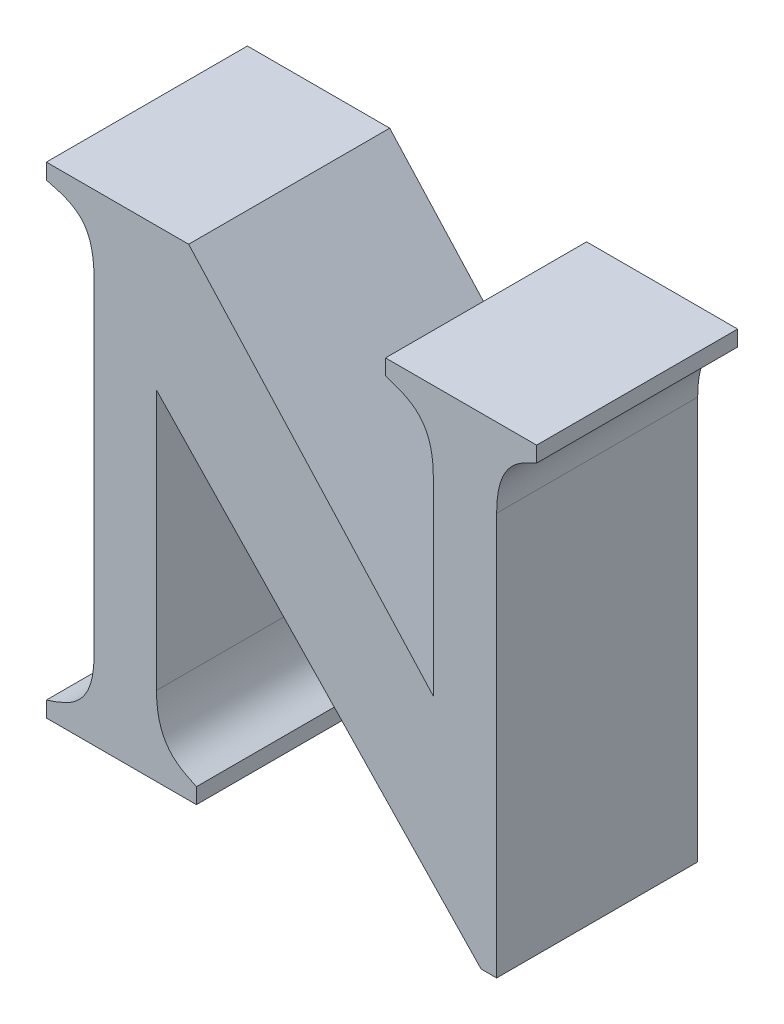
ISO-10303-21;
HEADER;
FILE_DESCRIPTION(('STEP AP214'),'2;1');
FILE_NAME('part.step','',(''),(''),'','','');
FILE_SCHEMA(('AUTOMOTIVE_DESIGN { 1 0 10303 214 1 1 1 1 }'));
ENDSEC;
DATA;
#1=APPLICATION_CONTEXT('core data for automotive mechanical design processes');
#2=APPLICATION_PROTOCOL_DEFINITION('international standard','automotive_design',2000,#1);
#3=PRODUCT_CONTEXT('',#1,'mechanical');
#4=PRODUCT('Part','Part','',(#3));
#5=PRODUCT_RELATED_PRODUCT_CATEGORY('part','',(#4));
#6=PRODUCT_DEFINITION_FORMATION('','',#4);
#7=PRODUCT_DEFINITION_CONTEXT('part definition',#1,'design');
#8=PRODUCT_DEFINITION('design','',#6,#7);
#9=PRODUCT_DEFINITION_SHAPE('','',#8);
#10=(LENGTH_UNIT() NAMED_UNIT(*) SI_UNIT(.MILLI.,.METRE.));
#11=(NAMED_UNIT(*) PLANE_ANGLE_UNIT() SI_UNIT($,.RADIAN.));
#12=(NAMED_UNIT(*) SI_UNIT($,.STERADIAN.) SOLID_ANGLE_UNIT());
#13=UNCERTAINTY_MEASURE_WITH_UNIT(LENGTH_MEASURE(1.E-05),#10,'distance_accuracy_value','');
#14=(GEOMETRIC_REPRESENTATION_CONTEXT(3) GLOBAL_UNCERTAINTY_ASSIGNED_CONTEXT((#13)) GLOBAL_UNIT_ASSIGNED_CONTEXT((#10,
#11,#12)) REPRESENTATION_CONTEXT('',''));
#15=CARTESIAN_POINT('',(0.,0.,0.));
#16=DIRECTION('',(0.,0.,1.));
#17=DIRECTION('',(1.,0.,0.));
#18=AXIS2_PLACEMENT_3D('',#15,#16,#17);
#19=CARTESIAN_POINT('',(4.0516665410295,-0.424294319298148,0.));
#20=DIRECTION('',(-1.,0.,0.));
#21=DIRECTION('',(0.,-1.,0.));
#22=AXIS2_PLACEMENT_3D('',#19,#20,#21);
#23=PLANE('',#22);
#24=DIRECTION('',(0.,1.,0.));
#25=VECTOR('',#24,1.);
#26=CARTESIAN_POINT('',(4.0516665410295,-0.432050714249068,0.));
#27=LINE('',#26,#25);
#28=CARTESIAN_POINT('',(4.0516665410295,-0.432050714249068,0.));
#29=VERTEX_POINT('',#28);
#30=CARTESIAN_POINT('',(4.0516665410295,-0.424294319298148,0.));
#31=VERTEX_POINT('',#30);
#32=EDGE_CURVE('E11',#29,#31,#27,.T.);
#33=ORIENTED_EDGE('',*,*,#32,.F.);
#34=DIRECTION('',(0.,0.,1.));
#35=VECTOR('',#34,1.);
#36=CARTESIAN_POINT('',(4.0516665410295,-0.432050714249068,0.));
#37=LINE('',#36,#35);
#38=CARTESIAN_POINT('',(4.0516665410295,-0.432050714249068,0.1));
#39=VERTEX_POINT('',#38);
#40=EDGE_CURVE('E24',#29,#39,#37,.T.);
#41=ORIENTED_EDGE('',*,*,#40,.T.);
#42=DIRECTION('',(0.,-1.,0.));
#43=VECTOR('',#42,1.);
#44=CARTESIAN_POINT('',(4.0516665410295,-0.432050714249068,0.1));
#45=LINE('',#44,#43);
#46=CARTESIAN_POINT('',(4.0516665410295,-0.424294319298148,0.1));
#47=VERTEX_POINT('',#46);
#48=EDGE_CURVE('E172',#47,#39,#45,.T.);
#49=ORIENTED_EDGE('',*,*,#48,.F.);
#50=DIRECTION('',(0.,0.,1.));
#51=VECTOR('',#50,1.);
#52=CARTESIAN_POINT('',(4.0516665410295,-0.424294319298148,0.));
#53=LINE('',#52,#51);
#54=EDGE_CURVE('E356',#31,#47,#53,.T.);
#55=ORIENTED_EDGE('',*,*,#54,.F.);
#56=EDGE_LOOP('',(#33,#41,#49,#55));
#57=FACE_BOUND('',#56,.T.);
#58=ADVANCED_FACE('F17',(#57),#23,.T.);
#59=CARTESIAN_POINT('',(4.0754206514392,-0.392784138206144,0.));
#60=CARTESIAN_POINT('',(4.0754206514392,-0.392784138206144,0.1));
#61=CARTESIAN_POINT('',(4.075420651555,-0.416537924702412,0.));
#62=CARTESIAN_POINT('',(4.075420651555,-0.416537924702412,0.1));
#63=CARTESIAN_POINT('',(4.0633016559453,-0.420416067951279,0.));
#64=CARTESIAN_POINT('',(4.0633016559453,-0.420416067951279,0.1));
#65=CARTESIAN_POINT('',(4.0516665410295,-0.424294319298148,0.));
#66=CARTESIAN_POINT('',(4.0516665410295,-0.424294319298148,0.1));
#67=B_SPLINE_SURFACE_WITH_KNOTS('',3,1,((#59,#60),(#61,#62),(#63,#64),(#65,#66)),.UNSPECIFIED.,
.F.,.F.,.F.,(4,4),(2,2),(-1.,0.),(0.,0.01),.UNSPECIFIED.);
#68=CARTESIAN_POINT('',(4.0516665410295,-0.424294319298148,0.));
#69=CARTESIAN_POINT('',(4.0633016559453,-0.420416067951279,0.));
#70=CARTESIAN_POINT('',(4.075420651555,-0.416537924702412,0.));
#71=CARTESIAN_POINT('',(4.0754206514392,-0.392784138206144,0.));
#72=B_SPLINE_CURVE_WITH_KNOTS('',3,(#68,#69,#70,#71),.UNSPECIFIED.,.F.,.F.,(4,4),(0.,1.),.UNSPECIFIED.);
#73=CARTESIAN_POINT('',(4.0754206514392,-0.392784138206144,0.));
#74=VERTEX_POINT('',#73);
#75=EDGE_CURVE('E349',#31,#74,#72,.T.);
#76=CARTESIAN_POINT('',(4.0754206514392,-0.392784138206144,0.1));
#77=CARTESIAN_POINT('',(4.075420651555,-0.416537924702412,0.1));
#78=CARTESIAN_POINT('',(4.0633016559453,-0.420416067951279,0.1));
#79=CARTESIAN_POINT('',(4.0516665410295,-0.424294319298148,0.1));
#80=B_SPLINE_CURVE_WITH_KNOTS('',3,(#76,#77,#78,#79),.UNSPECIFIED.,.F.,.F.,(4,4),(-1.,0.),.UNSPECIFIED.);
#81=CARTESIAN_POINT('',(4.0754206514392,-0.392784138206144,0.1));
#82=VERTEX_POINT('',#81);
#83=EDGE_CURVE('E345',#82,#47,#80,.T.);
#84=DIRECTION('',(0.,0.,1.));
#85=VECTOR('',#84,1.);
#86=CARTESIAN_POINT('',(4.0754206514392,-0.392784138206144,0.));
#87=LINE('',#86,#85);
#88=EDGE_CURVE('E342',#74,#82,#87,.T.);
#89=ORIENTED_EDGE('',*,*,#75,.F.);
#90=ORIENTED_EDGE('',*,*,#54,.T.);
#91=ORIENTED_EDGE('',*,*,#83,.F.);
#92=ORIENTED_EDGE('',*,*,#88,.F.);
#93=EDGE_LOOP('',(#89,#90,#91,#92));
#94=FACE_BOUND('',#93,.T.);
#95=ADVANCED_FACE('F429',(#94),#67,.T.);
#96=CARTESIAN_POINT('',(4.0754206514392,-0.231839582517053,0.));
#97=DIRECTION('',(-1.,0.,0.));
#98=DIRECTION('',(0.,-1.,0.));
#99=AXIS2_PLACEMENT_3D('',#96,#97,#98);
#100=PLANE('',#99);
#101=DIRECTION('',(0.,1.,0.));
#102=VECTOR('',#101,1.);
#103=CARTESIAN_POINT('',(4.0754206514392,-0.392784138206144,0.));
#104=LINE('',#103,#102);
#105=CARTESIAN_POINT('',(4.0754206514392,-0.231839582517053,0.));
#106=VERTEX_POINT('',#105);
#107=EDGE_CURVE('E340',#74,#106,#104,.T.);
#108=ORIENTED_EDGE('',*,*,#107,.F.);
#109=ORIENTED_EDGE('',*,*,#88,.T.);
#110=DIRECTION('',(0.,-1.,0.));
#111=VECTOR('',#110,1.);
#112=CARTESIAN_POINT('',(4.0754206514392,-0.392784138206144,0.1));
#113=LINE('',#112,#111);
#114=CARTESIAN_POINT('',(4.0754206514392,-0.231839582517053,0.1));
#115=VERTEX_POINT('',#114);
#116=EDGE_CURVE('E337',#115,#82,#113,.T.);
#117=ORIENTED_EDGE('',*,*,#116,.F.);
#118=DIRECTION('',(0.,0.,1.));
#119=VECTOR('',#118,1.);
#120=CARTESIAN_POINT('',(4.0754206514392,-0.231839582517053,0.));
#121=LINE('',#120,#119);
#122=EDGE_CURVE('E331',#106,#115,#121,.T.);
#123=ORIENTED_EDGE('',*,*,#122,.F.);
#124=EDGE_LOOP('',(#108,#109,#117,#123));
#125=FACE_BOUND('',#124,.T.);
#126=ADVANCED_FACE('F425',(#125),#100,.T.);
#127=CARTESIAN_POINT('',(4.0516665410295,-0.200329401425036,0.));
#128=CARTESIAN_POINT('',(4.0516665410295,-0.200329401425036,0.1));
#129=CARTESIAN_POINT('',(4.06717918681,-0.204207508825576,0.));
#130=CARTESIAN_POINT('',(4.06717918681,-0.204207508825576,0.1));
#131=CARTESIAN_POINT('',(4.0754206514389,-0.2080857603454,0.));
#132=CARTESIAN_POINT('',(4.0754206514389,-0.2080857603454,0.1));
#133=CARTESIAN_POINT('',(4.0754206514392,-0.231839582517053,0.));
#134=CARTESIAN_POINT('',(4.0754206514392,-0.231839582517053,0.1));
#135=B_SPLINE_SURFACE_WITH_KNOTS('',3,1,((#127,#128),(#129,#130),(#131,#132),(#133,#134)),
.UNSPECIFIED.,.F.,.F.,.F.,(4,4),(2,2),(-1.,0.),(0.,0.01),.UNSPECIFIED.);
#136=CARTESIAN_POINT('',(4.0754206514392,-0.231839582517053,0.));
#137=CARTESIAN_POINT('',(4.0754206514389,-0.2080857603454,0.));
#138=CARTESIAN_POINT('',(4.06717918681,-0.204207508825576,0.));
#139=CARTESIAN_POINT('',(4.0516665410295,-0.200329401425036,0.));
#140=B_SPLINE_CURVE_WITH_KNOTS('',3,(#136,#137,#138,#139),.UNSPECIFIED.,.F.,.F.,(4,4),(0.,1.),.UNSPECIFIED.);
#141=CARTESIAN_POINT('',(4.0516665410295,-0.200329401425036,0.));
#142=VERTEX_POINT('',#141);
#143=EDGE_CURVE('E324',#106,#142,#140,.T.);
#144=CARTESIAN_POINT('',(4.0516665410295,-0.200329401425036,0.1));
#145=CARTESIAN_POINT('',(4.06717918681,-0.204207508825576,0.1));
#146=CARTESIAN_POINT('',(4.0754206514389,-0.2080857603454,0.1));
#147=CARTESIAN_POINT('',(4.0754206514392,-0.231839582517053,0.1));
#148=B_SPLINE_CURVE_WITH_KNOTS('',3,(#144,#145,#146,#147),.UNSPECIFIED.,.F.,.F.,(4,4),(-1.,0.),.UNSPECIFIED.);
#149=CARTESIAN_POINT('',(4.0516665410295,-0.200329401425036,0.1));
#150=VERTEX_POINT('',#149);
#151=EDGE_CURVE('E319',#150,#115,#148,.T.);
#152=DIRECTION('',(0.,0.,1.));
#153=VECTOR('',#152,1.);
#154=CARTESIAN_POINT('',(4.0516665410295,-0.200329401425036,0.));
#155=LINE('',#154,#153);
#156=EDGE_CURVE('E316',#142,#150,#155,.T.);
#157=ORIENTED_EDGE('',*,*,#143,.F.);
#158=ORIENTED_EDGE('',*,*,#122,.T.);
#159=ORIENTED_EDGE('',*,*,#151,.F.);
#160=ORIENTED_EDGE('',*,*,#156,.F.);
#161=EDGE_LOOP('',(#157,#158,#159,#160));
#162=FACE_BOUND('',#161,.T.);
#163=ADVANCED_FACE('F421',(#162),#135,.T.);
#164=CARTESIAN_POINT('',(4.0516665410295,-0.19257300647474,0.));
#165=DIRECTION('',(-1.,0.,0.));
#166=DIRECTION('',(0.,-1.,0.));
#167=AXIS2_PLACEMENT_3D('',#164,#165,#166);
#168=PLANE('',#167);
#169=DIRECTION('',(0.,1.,0.));
#170=VECTOR('',#169,1.);
#171=CARTESIAN_POINT('',(4.0516665410295,-0.200329401425036,0.));
#172=LINE('',#171,#170);
#173=CARTESIAN_POINT('',(4.0516665410295,-0.19257300647474,0.));
#174=VERTEX_POINT('',#173);
#175=EDGE_CURVE('E314',#142,#174,#172,.T.);
#176=ORIENTED_EDGE('',*,*,#175,.F.);
#177=ORIENTED_EDGE('',*,*,#156,.T.);
#178=DIRECTION('',(0.,-1.,0.));
#179=VECTOR('',#178,1.);
#180=CARTESIAN_POINT('',(4.0516665410295,-0.200329401425036,0.1));
#181=LINE('',#180,#179);
#182=CARTESIAN_POINT('',(4.0516665410295,-0.19257300647474,0.1));
#183=VERTEX_POINT('',#182);
#184=EDGE_CURVE('E311',#183,#150,#181,.T.);
#185=ORIENTED_EDGE('',*,*,#184,.F.);
#186=DIRECTION('',(0.,0.,1.));
#187=VECTOR('',#186,1.);
#188=CARTESIAN_POINT('',(4.0516665410295,-0.19257300647474,0.));
#189=LINE('',#188,#187);
#190=EDGE_CURVE('E308',#174,#183,#189,.T.);
#191=ORIENTED_EDGE('',*,*,#190,.F.);
#192=EDGE_LOOP('',(#176,#177,#185,#191));
#193=FACE_BOUND('',#192,.T.);
#194=ADVANCED_FACE('F417',(#193),#168,.T.);
#195=CARTESIAN_POINT('',(4.1224431900738,-0.19257300647474,0.));
#196=DIRECTION('',(0.,1.,0.));
#197=DIRECTION('',(-1.,0.,0.));
#198=AXIS2_PLACEMENT_3D('',#195,#196,#197);
#199=PLANE('',#198);
#200=DIRECTION('',(1.,0.,0.));
#201=VECTOR('',#200,1.);
#202=CARTESIAN_POINT('',(4.0516665410295,-0.19257300647474,0.));
#203=LINE('',#202,#201);
#204=CARTESIAN_POINT('',(4.1224431900738,-0.19257300647474,0.));
#205=VERTEX_POINT('',#204);
#206=EDGE_CURVE('E306',#174,#205,#203,.T.);
#207=ORIENTED_EDGE('',*,*,#206,.F.);
#208=ORIENTED_EDGE('',*,*,#190,.T.);
#209=DIRECTION('',(-1.,0.,0.));
#210=VECTOR('',#209,1.);
#211=CARTESIAN_POINT('',(4.0516665410295,-0.19257300647474,0.1));
#212=LINE('',#211,#210);
#213=CARTESIAN_POINT('',(4.1224431900738,-0.19257300647474,0.1));
#214=VERTEX_POINT('',#213);
#215=EDGE_CURVE('E303',#214,#183,#212,.T.);
#216=ORIENTED_EDGE('',*,*,#215,.F.);
#217=DIRECTION('',(0.,0.,1.));
#218=VECTOR('',#217,1.);
#219=CARTESIAN_POINT('',(4.1224431900738,-0.19257300647474,0.));
#220=LINE('',#219,#218);
#221=EDGE_CURVE('E300',#205,#214,#220,.T.);
#222=ORIENTED_EDGE('',*,*,#221,.F.);
#223=EDGE_LOOP('',(#207,#208,#216,#222));
#224=FACE_BOUND('',#223,.T.);
#225=ADVANCED_FACE('F413',(#224),#199,.T.);
#226=CARTESIAN_POINT('',(4.2441213498704,-0.326370269912293,0.));
#227=DIRECTION('',(0.739818183486608,0.672806848495596,0.));
#228=DIRECTION('',(-0.672806848495596,0.739818183486608,0.));
#229=AXIS2_PLACEMENT_3D('',#226,#227,#228);
#230=PLANE('',#229);
#231=DIRECTION('',(0.672806848495596,-0.739818183486608,0.));
#232=VECTOR('',#231,1.);
#233=CARTESIAN_POINT('',(4.1224431900738,-0.19257300647474,0.));
#234=LINE('',#233,#232);
#235=CARTESIAN_POINT('',(4.2441213498704,-0.326370269912293,0.));
#236=VERTEX_POINT('',#235);
#237=EDGE_CURVE('E298',#205,#236,#234,.T.);
#238=ORIENTED_EDGE('',*,*,#237,.F.);
#239=ORIENTED_EDGE('',*,*,#221,.T.);
#240=DIRECTION('',(-0.672806848495596,0.739818183486608,0.));
#241=VECTOR('',#240,1.);
#242=CARTESIAN_POINT('',(4.1224431900738,-0.19257300647474,0.1));
#243=LINE('',#242,#241);
#244=CARTESIAN_POINT('',(4.2441213498704,-0.326370269912293,0.1));
#245=VERTEX_POINT('',#244);
#246=EDGE_CURVE('E295',#245,#214,#243,.T.);
#247=ORIENTED_EDGE('',*,*,#246,.F.);
#248=DIRECTION('',(0.,0.,1.));
#249=VECTOR('',#248,1.);
#250=CARTESIAN_POINT('',(4.2441213498704,-0.326370269912293,0.));
#251=LINE('',#250,#249);
#252=EDGE_CURVE('E292',#236,#245,#251,.T.);
#253=ORIENTED_EDGE('',*,*,#252,.F.);
#254=EDGE_LOOP('',(#238,#239,#247,#253));
#255=FACE_BOUND('',#254,.T.);
#256=ADVANCED_FACE('F409',(#255),#230,.T.);
#257=CARTESIAN_POINT('',(4.2441213498704,-0.231839582517053,0.));
#258=DIRECTION('',(-1.,0.,0.));
#259=DIRECTION('',(0.,-1.,0.));
#260=AXIS2_PLACEMENT_3D('',#257,#258,#259);
#261=PLANE('',#260);
#262=DIRECTION('',(0.,1.,0.));
#263=VECTOR('',#262,1.);
#264=CARTESIAN_POINT('',(4.2441213498704,-0.326370269912293,0.));
#265=LINE('',#264,#263);
#266=CARTESIAN_POINT('',(4.2441213498704,-0.231839582517053,0.));
#267=VERTEX_POINT('',#266);
#268=EDGE_CURVE('E290',#236,#267,#265,.T.);
#269=ORIENTED_EDGE('',*,*,#268,.F.);
#270=ORIENTED_EDGE('',*,*,#252,.T.);
#271=DIRECTION('',(0.,-1.,0.));
#272=VECTOR('',#271,1.);
#273=CARTESIAN_POINT('',(4.2441213498704,-0.326370269912293,0.1));
#274=LINE('',#273,#272);
#275=CARTESIAN_POINT('',(4.2441213498704,-0.231839582517053,0.1));
#276=VERTEX_POINT('',#275);
#277=EDGE_CURVE('E287',#276,#245,#274,.T.);
#278=ORIENTED_EDGE('',*,*,#277,.F.);
#279=DIRECTION('',(0.,0.,1.));
#280=VECTOR('',#279,1.);
#281=CARTESIAN_POINT('',(4.2441213498704,-0.231839582517053,0.));
#282=LINE('',#281,#280);
#283=EDGE_CURVE('E281',#267,#276,#282,.T.);
#284=ORIENTED_EDGE('',*,*,#283,.F.);
#285=EDGE_LOOP('',(#269,#270,#278,#284));
#286=FACE_BOUND('',#285,.T.);
#287=ADVANCED_FACE('F405',(#286),#261,.T.);
#288=CARTESIAN_POINT('',(4.2203675997584,-0.200329401425036,0.));
#289=CARTESIAN_POINT('',(4.2203675997584,-0.200329401425036,0.1));
#290=CARTESIAN_POINT('',(4.2324862350122,-0.204207508825576,0.));
#291=CARTESIAN_POINT('',(4.2324862350122,-0.204207508825576,0.1));
#292=CARTESIAN_POINT('',(4.2441213498702,-0.208085760345405,0.));
#293=CARTESIAN_POINT('',(4.2441213498702,-0.208085760345405,0.1));
#294=CARTESIAN_POINT('',(4.2441213498704,-0.231839582517053,0.));
#295=CARTESIAN_POINT('',(4.2441213498704,-0.231839582517053,0.1));
#296=B_SPLINE_SURFACE_WITH_KNOTS('',3,1,((#288,#289),(#290,#291),(#292,#293),(#294,#295)),
.UNSPECIFIED.,.F.,.F.,.F.,(4,4),(2,2),(-1.,0.),(0.,0.01),.UNSPECIFIED.);
#297=CARTESIAN_POINT('',(4.2441213498704,-0.231839582517053,0.));
#298=CARTESIAN_POINT('',(4.2441213498702,-0.208085760345405,0.));
#299=CARTESIAN_POINT('',(4.2324862350122,-0.204207508825576,0.));
#300=CARTESIAN_POINT('',(4.2203675997584,-0.200329401425036,0.));
#301=B_SPLINE_CURVE_WITH_KNOTS('',3,(#297,#298,#299,#300),.UNSPECIFIED.,.F.,.F.,(4,4),(0.,1.),.UNSPECIFIED.);
#302=CARTESIAN_POINT('',(4.2203675997584,-0.200329401425036,0.));
#303=VERTEX_POINT('',#302);
#304=EDGE_CURVE('E274',#267,#303,#301,.T.);
#305=CARTESIAN_POINT('',(4.2203675997584,-0.200329401425036,0.1));
#306=CARTESIAN_POINT('',(4.2324862350122,-0.204207508825576,0.1));
#307=CARTESIAN_POINT('',(4.2441213498702,-0.208085760345405,0.1));
#308=CARTESIAN_POINT('',(4.2441213498704,-0.231839582517053,0.1));
#309=B_SPLINE_CURVE_WITH_KNOTS('',3,(#305,#306,#307,#308),.UNSPECIFIED.,.F.,.F.,(4,4),(-1.,0.),.UNSPECIFIED.);
#310=CARTESIAN_POINT('',(4.2203675997584,-0.200329401425036,0.1));
#311=VERTEX_POINT('',#310);
#312=EDGE_CURVE('E269',#311,#276,#309,.T.);
#313=DIRECTION('',(0.,0.,1.));
#314=VECTOR('',#313,1.);
#315=CARTESIAN_POINT('',(4.2203675997584,-0.200329401425036,0.));
#316=LINE('',#315,#314);
#317=EDGE_CURVE('E266',#303,#311,#316,.T.);
#318=ORIENTED_EDGE('',*,*,#304,.F.);
#319=ORIENTED_EDGE('',*,*,#283,.T.);
#320=ORIENTED_EDGE('',*,*,#312,.F.);
#321=ORIENTED_EDGE('',*,*,#317,.F.);
#322=EDGE_LOOP('',(#318,#319,#320,#321));
#323=FACE_BOUND('',#322,.T.);
#324=ADVANCED_FACE('F401',(#323),#296,.T.);
#325=CARTESIAN_POINT('',(4.2203675997584,-0.19257300647474,0.));
#326=DIRECTION('',(-1.,0.,0.));
#327=DIRECTION('',(0.,-1.,0.));
#328=AXIS2_PLACEMENT_3D('',#325,#326,#327);
#329=PLANE('',#328);
#330=DIRECTION('',(0.,1.,0.));
#331=VECTOR('',#330,1.);
#332=CARTESIAN_POINT('',(4.2203675997584,-0.200329401425036,0.));
#333=LINE('',#332,#331);
#334=CARTESIAN_POINT('',(4.2203675997584,-0.19257300647474,0.));
#335=VERTEX_POINT('',#334);
#336=EDGE_CURVE('E264',#303,#335,#333,.T.);
#337=ORIENTED_EDGE('',*,*,#336,.F.);
#338=ORIENTED_EDGE('',*,*,#317,.T.);
#339=DIRECTION('',(0.,-1.,0.));
#340=VECTOR('',#339,1.);
#341=CARTESIAN_POINT('',(4.2203675997584,-0.200329401425036,0.1));
#342=LINE('',#341,#340);
#343=CARTESIAN_POINT('',(4.2203675997584,-0.19257300647474,0.1));
#344=VERTEX_POINT('',#343);
#345=EDGE_CURVE('E261',#344,#311,#342,.T.);
#346=ORIENTED_EDGE('',*,*,#345,.F.);
#347=DIRECTION('',(0.,0.,1.));
#348=VECTOR('',#347,1.);
#349=CARTESIAN_POINT('',(4.2203675997584,-0.19257300647474,0.));
#350=LINE('',#349,#348);
#351=EDGE_CURVE('E258',#335,#344,#350,.T.);
#352=ORIENTED_EDGE('',*,*,#351,.F.);
#353=EDGE_LOOP('',(#337,#338,#346,#352));
#354=FACE_BOUND('',#353,.T.);
#355=ADVANCED_FACE('F397',(#354),#329,.T.);
#356=CARTESIAN_POINT('',(4.2955067413159,-0.19257300647474,0.));
#357=DIRECTION('',(0.,1.,0.));
#358=DIRECTION('',(-1.,0.,0.));
#359=AXIS2_PLACEMENT_3D('',#356,#357,#358);
#360=PLANE('',#359);
#361=DIRECTION('',(1.,0.,0.));
#362=VECTOR('',#361,1.);
#363=CARTESIAN_POINT('',(4.2203675997584,-0.19257300647474,0.));
#364=LINE('',#363,#362);
#365=CARTESIAN_POINT('',(4.2955067413159,-0.19257300647474,0.));
#366=VERTEX_POINT('',#365);
#367=EDGE_CURVE('E256',#335,#366,#364,.T.);
#368=ORIENTED_EDGE('',*,*,#367,.F.);
#369=ORIENTED_EDGE('',*,*,#351,.T.);
#370=DIRECTION('',(-1.,0.,0.));
#371=VECTOR('',#370,1.);
#372=CARTESIAN_POINT('',(4.2203675997584,-0.19257300647474,0.1));
#373=LINE('',#372,#371);
#374=CARTESIAN_POINT('',(4.2955067413159,-0.19257300647474,0.1));
#375=VERTEX_POINT('',#374);
#376=EDGE_CURVE('E253',#375,#344,#373,.T.);
#377=ORIENTED_EDGE('',*,*,#376,.F.);
#378=DIRECTION('',(0.,0.,1.));
#379=VECTOR('',#378,1.);
#380=CARTESIAN_POINT('',(4.2955067413159,-0.19257300647474,0.));
#381=LINE('',#380,#379);
#382=EDGE_CURVE('E250',#366,#375,#381,.T.);
#383=ORIENTED_EDGE('',*,*,#382,.F.);
#384=EDGE_LOOP('',(#368,#369,#377,#383));
#385=FACE_BOUND('',#384,.T.);
#386=ADVANCED_FACE('F393',(#385),#360,.T.);
#387=CARTESIAN_POINT('',(4.2955067413159,-0.200329401425036,0.));
#388=DIRECTION('',(1.,0.,0.));
#389=DIRECTION('',(0.,1.,0.));
#390=AXIS2_PLACEMENT_3D('',#387,#388,#389);
#391=PLANE('',#390);
#392=DIRECTION('',(0.,-1.,0.));
#393=VECTOR('',#392,1.);
#394=CARTESIAN_POINT('',(4.2955067413159,-0.19257300647474,0.));
#395=LINE('',#394,#393);
#396=CARTESIAN_POINT('',(4.2955067413159,-0.200329401425036,0.));
#397=VERTEX_POINT('',#396);
#398=EDGE_CURVE('E248',#366,#397,#395,.T.);
#399=ORIENTED_EDGE('',*,*,#398,.F.);
#400=ORIENTED_EDGE('',*,*,#382,.T.);
#401=DIRECTION('',(0.,1.,0.));
#402=VECTOR('',#401,1.);
#403=CARTESIAN_POINT('',(4.2955067413159,-0.19257300647474,0.1));
#404=LINE('',#403,#402);
#405=CARTESIAN_POINT('',(4.2955067413159,-0.200329401425036,0.1));
#406=VERTEX_POINT('',#405);
#407=EDGE_CURVE('E245',#406,#375,#404,.T.);
#408=ORIENTED_EDGE('',*,*,#407,.F.);
#409=DIRECTION('',(0.,0.,1.));
#410=VECTOR('',#409,1.);
#411=CARTESIAN_POINT('',(4.2955067413159,-0.200329401425036,0.));
#412=LINE('',#411,#410);
#413=EDGE_CURVE('E239',#397,#406,#412,.T.);
#414=ORIENTED_EDGE('',*,*,#413,.F.);
#415=EDGE_LOOP('',(#399,#400,#408,#414));
#416=FACE_BOUND('',#415,.T.);
#417=ADVANCED_FACE('F389',(#416),#391,.T.);
#418=CARTESIAN_POINT('',(4.2756316030217,-0.231839582517053,0.));
#419=CARTESIAN_POINT('',(4.2756316030217,-0.231839582517053,0.1));
#420=CARTESIAN_POINT('',(4.2756316030215,-0.208085760345407,0.));
#421=CARTESIAN_POINT('',(4.2756316030215,-0.208085760345407,0.1));
#422=CARTESIAN_POINT('',(4.28726671788,-0.204207508825581,0.));
#423=CARTESIAN_POINT('',(4.28726671788,-0.204207508825581,0.1));
#424=CARTESIAN_POINT('',(4.2955067413159,-0.200329401425036,0.));
#425=CARTESIAN_POINT('',(4.2955067413159,-0.200329401425036,0.1));
#426=B_SPLINE_SURFACE_WITH_KNOTS('',3,1,((#418,#419),(#420,#421),(#422,#423),(#424,#425)),
.UNSPECIFIED.,.F.,.F.,.F.,(4,4),(2,2),(-1.,0.),(0.,0.01),.UNSPECIFIED.);
#427=CARTESIAN_POINT('',(4.2955067413159,-0.200329401425036,0.));
#428=CARTESIAN_POINT('',(4.28726671788,-0.204207508825581,0.));
#429=CARTESIAN_POINT('',(4.2756316030215,-0.208085760345407,0.));
#430=CARTESIAN_POINT('',(4.2756316030217,-0.231839582517053,0.));
#431=B_SPLINE_CURVE_WITH_KNOTS('',3,(#427,#428,#429,#430),.UNSPECIFIED.,.F.,.F.,(4,4),(0.,1.),.UNSPECIFIED.);
#432=CARTESIAN_POINT('',(4.2756316030217,-0.231839582517053,0.));
#433=VERTEX_POINT('',#432);
#434=EDGE_CURVE('E232',#397,#433,#431,.T.);
#435=CARTESIAN_POINT('',(4.2756316030217,-0.231839582517053,0.1));
#436=CARTESIAN_POINT('',(4.2756316030215,-0.208085760345407,0.1));
#437=CARTESIAN_POINT('',(4.28726671788,-0.204207508825581,0.1));
#438=CARTESIAN_POINT('',(4.2955067413159,-0.200329401425036,0.1));
#439=B_SPLINE_CURVE_WITH_KNOTS('',3,(#435,#436,#437,#438),.UNSPECIFIED.,.F.,.F.,(4,4),(-1.,0.),.UNSPECIFIED.);
#440=CARTESIAN_POINT('',(4.2756316030217,-0.231839582517053,0.1));
#441=VERTEX_POINT('',#440);
#442=EDGE_CURVE('E227',#441,#406,#439,.T.);
#443=DIRECTION('',(0.,0.,1.));
#444=VECTOR('',#443,1.);
#445=CARTESIAN_POINT('',(4.2756316030217,-0.231839582517053,0.));
#446=LINE('',#445,#444);
#447=EDGE_CURVE('E224',#433,#441,#446,.T.);
#448=ORIENTED_EDGE('',*,*,#434,.F.);
#449=ORIENTED_EDGE('',*,*,#413,.T.);
#450=ORIENTED_EDGE('',*,*,#442,.F.);
#451=ORIENTED_EDGE('',*,*,#447,.F.);
#452=EDGE_LOOP('',(#448,#449,#450,#451));
#453=FACE_BOUND('',#452,.T.);
#454=ADVANCED_FACE('F385',(#453),#426,.T.);
#455=CARTESIAN_POINT('',(4.2756316030217,-0.432050714249068,0.));
#456=DIRECTION('',(1.,0.,0.));
#457=DIRECTION('',(0.,1.,0.));
#458=AXIS2_PLACEMENT_3D('',#455,#456,#457);
#459=PLANE('',#458);
#460=DIRECTION('',(0.,-1.,0.));
#461=VECTOR('',#460,1.);
#462=CARTESIAN_POINT('',(4.2756316030217,-0.231839582517053,0.));
#463=LINE('',#462,#461);
#464=CARTESIAN_POINT('',(4.2756316030217,-0.432050714249068,0.));
#465=VERTEX_POINT('',#464);
#466=EDGE_CURVE('E222',#433,#465,#463,.T.);
#467=ORIENTED_EDGE('',*,*,#466,.F.);
#468=ORIENTED_EDGE('',*,*,#447,.T.);
#469=DIRECTION('',(0.,1.,0.));
#470=VECTOR('',#469,1.);
#471=CARTESIAN_POINT('',(4.2756316030217,-0.231839582517053,0.1));
#472=LINE('',#471,#470);
#473=CARTESIAN_POINT('',(4.2756316030217,-0.432050714249068,0.1));
#474=VERTEX_POINT('',#473);
#475=EDGE_CURVE('E219',#474,#441,#472,.T.);
#476=ORIENTED_EDGE('',*,*,#475,.F.);
#477=DIRECTION('',(0.,0.,1.));
#478=VECTOR('',#477,1.);
#479=CARTESIAN_POINT('',(4.2756316030217,-0.432050714249068,0.));
#480=LINE('',#479,#478);
#481=EDGE_CURVE('E216',#465,#474,#480,.T.);
#482=ORIENTED_EDGE('',*,*,#481,.F.);
#483=EDGE_LOOP('',(#467,#468,#476,#482));
#484=FACE_BOUND('',#483,.T.);
#485=ADVANCED_FACE('F381',(#484),#459,.T.);
#486=CARTESIAN_POINT('',(4.2678754602801,-0.432050714249068,0.));
#487=DIRECTION('',(0.,-1.,0.));
#488=DIRECTION('',(1.,0.,0.));
#489=AXIS2_PLACEMENT_3D('',#486,#487,#488);
#490=PLANE('',#489);
#491=DIRECTION('',(-1.,0.,0.));
#492=VECTOR('',#491,1.);
#493=CARTESIAN_POINT('',(4.2756316030217,-0.432050714249068,0.));
#494=LINE('',#493,#492);
#495=CARTESIAN_POINT('',(4.2678754602801,-0.432050714249068,0.));
#496=VERTEX_POINT('',#495);
#497=EDGE_CURVE('E214',#465,#496,#494,.T.);
#498=ORIENTED_EDGE('',*,*,#497,.F.);
#499=ORIENTED_EDGE('',*,*,#481,.T.);
#500=DIRECTION('',(1.,0.,0.));
#501=VECTOR('',#500,1.);
#502=CARTESIAN_POINT('',(4.2756316030217,-0.432050714249068,0.1));
#503=LINE('',#502,#501);
#504=CARTESIAN_POINT('',(4.2678754602801,-0.432050714249068,0.1));
#505=VERTEX_POINT('',#504);
#506=EDGE_CURVE('E211',#505,#474,#503,.T.);
#507=ORIENTED_EDGE('',*,*,#506,.F.);
#508=DIRECTION('',(0.,0.,1.));
#509=VECTOR('',#508,1.);
#510=CARTESIAN_POINT('',(4.2678754602801,-0.432050714249068,0.));
#511=LINE('',#510,#509);
#512=EDGE_CURVE('E208',#496,#505,#511,.T.);
#513=ORIENTED_EDGE('',*,*,#512,.F.);
#514=EDGE_LOOP('',(#498,#499,#507,#513));
#515=FACE_BOUND('',#514,.T.);
#516=ADVANCED_FACE('F377',(#515),#490,.T.);
#517=CARTESIAN_POINT('',(4.1064455827034,-0.263349763608539,0.));
#518=DIRECTION('',(-0.722505463033566,-0.69136521165492,0.));
#519=DIRECTION('',(0.69136521165492,-0.722505463033566,0.));
#520=AXIS2_PLACEMENT_3D('',#517,#518,#519);
#521=PLANE('',#520);
#522=DIRECTION('',(-0.69136521165492,0.722505463033566,0.));
#523=VECTOR('',#522,1.);
#524=CARTESIAN_POINT('',(4.2678754602801,-0.432050714249068,0.));
#525=LINE('',#524,#523);
#526=CARTESIAN_POINT('',(4.1064455827034,-0.263349763608539,0.));
#527=VERTEX_POINT('',#526);
#528=EDGE_CURVE('E206',#496,#527,#525,.T.);
#529=ORIENTED_EDGE('',*,*,#528,.F.);
#530=ORIENTED_EDGE('',*,*,#512,.T.);
#531=DIRECTION('',(0.69136521165492,-0.722505463033566,0.));
#532=VECTOR('',#531,1.);
#533=CARTESIAN_POINT('',(4.2678754602801,-0.432050714249068,0.1));
#534=LINE('',#533,#532);
#535=CARTESIAN_POINT('',(4.1064455827034,-0.263349763608539,0.1));
#536=VERTEX_POINT('',#535);
#537=EDGE_CURVE('E203',#536,#505,#534,.T.);
#538=ORIENTED_EDGE('',*,*,#537,.F.);
#539=DIRECTION('',(0.,0.,1.));
#540=VECTOR('',#539,1.);
#541=CARTESIAN_POINT('',(4.1064455827034,-0.263349763608539,0.));
#542=LINE('',#541,#540);
#543=EDGE_CURVE('E200',#527,#536,#542,.T.);
#544=ORIENTED_EDGE('',*,*,#543,.F.);
#545=EDGE_LOOP('',(#529,#530,#538,#544));
#546=FACE_BOUND('',#545,.T.);
#547=ADVANCED_FACE('F373',(#546),#521,.T.);
#548=CARTESIAN_POINT('',(4.1064455827034,-0.392784138206144,0.));
#549=DIRECTION('',(1.,0.,0.));
#550=DIRECTION('',(0.,1.,0.));
#551=AXIS2_PLACEMENT_3D('',#548,#549,#550);
#552=PLANE('',#551);
#553=DIRECTION('',(0.,-1.,0.));
#554=VECTOR('',#553,1.);
#555=CARTESIAN_POINT('',(4.1064455827034,-0.263349763608539,0.));
#556=LINE('',#555,#554);
#557=CARTESIAN_POINT('',(4.1064455827034,-0.392784138206144,0.));
#558=VERTEX_POINT('',#557);
#559=EDGE_CURVE('E198',#527,#558,#556,.T.);
#560=ORIENTED_EDGE('',*,*,#559,.F.);
#561=ORIENTED_EDGE('',*,*,#543,.T.);
#562=DIRECTION('',(0.,1.,0.));
#563=VECTOR('',#562,1.);
#564=CARTESIAN_POINT('',(4.1064455827034,-0.263349763608539,0.1));
#565=LINE('',#564,#563);
#566=CARTESIAN_POINT('',(4.1064455827034,-0.392784138206144,0.1));
#567=VERTEX_POINT('',#566);
#568=EDGE_CURVE('E195',#567,#536,#565,.T.);
#569=ORIENTED_EDGE('',*,*,#568,.F.);
#570=DIRECTION('',(0.,0.,1.));
#571=VECTOR('',#570,1.);
#572=CARTESIAN_POINT('',(4.1064455827034,-0.392784138206144,0.));
#573=LINE('',#572,#571);
#574=EDGE_CURVE('E189',#558,#567,#573,.T.);
#575=ORIENTED_EDGE('',*,*,#574,.F.);
#576=EDGE_LOOP('',(#560,#561,#569,#575));
#577=FACE_BOUND('',#576,.T.);
#578=ADVANCED_FACE('F369',(#577),#552,.T.);
#579=CARTESIAN_POINT('',(4.1263221621904,-0.424294319298148,0.));
#580=CARTESIAN_POINT('',(4.1263221621904,-0.424294319298148,0.1));
#581=CARTESIAN_POINT('',(4.1185660194502,-0.420416067777874,0.));
#582=CARTESIAN_POINT('',(4.1185660194502,-0.420416067777874,0.1));
#583=CARTESIAN_POINT('',(4.1064455827031,-0.416537924348323,0.));
#584=CARTESIAN_POINT('',(4.1064455827031,-0.416537924348323,0.1));
#585=CARTESIAN_POINT('',(4.1064455827034,-0.392784138206144,0.));
#586=CARTESIAN_POINT('',(4.1064455827034,-0.392784138206144,0.1));
#587=B_SPLINE_SURFACE_WITH_KNOTS('',3,1,((#579,#580),(#581,#582),(#583,#584),(#585,#586)),
.UNSPECIFIED.,.F.,.F.,.F.,(4,4),(2,2),(-1.,0.),(0.,0.01),.UNSPECIFIED.);
#588=CARTESIAN_POINT('',(4.1064455827034,-0.392784138206144,0.));
#589=CARTESIAN_POINT('',(4.1064455827031,-0.416537924348323,0.));
#590=CARTESIAN_POINT('',(4.1185660194502,-0.420416067777874,0.));
#591=CARTESIAN_POINT('',(4.1263221621904,-0.424294319298148,0.));
#592=B_SPLINE_CURVE_WITH_KNOTS('',3,(#588,#589,#590,#591),.UNSPECIFIED.,.F.,.F.,(4,4),(0.,1.),.UNSPECIFIED.);
#593=CARTESIAN_POINT('',(4.1263221621904,-0.424294319298148,0.));
#594=VERTEX_POINT('',#593);
#595=EDGE_CURVE('E182',#558,#594,#592,.T.);
#596=CARTESIAN_POINT('',(4.1263221621904,-0.424294319298148,0.1));
#597=CARTESIAN_POINT('',(4.1185660194502,-0.420416067777874,0.1));
#598=CARTESIAN_POINT('',(4.1064455827031,-0.416537924348323,0.1));
#599=CARTESIAN_POINT('',(4.1064455827034,-0.392784138206144,0.1));
#600=B_SPLINE_CURVE_WITH_KNOTS('',3,(#596,#597,#598,#599),.UNSPECIFIED.,.F.,.F.,(4,4),(-1.,0.),.UNSPECIFIED.);
#601=CARTESIAN_POINT('',(4.1263221621904,-0.424294319298148,0.1));
#602=VERTEX_POINT('',#601);
#603=EDGE_CURVE('E178',#602,#567,#600,.T.);
#604=DIRECTION('',(0.,0.,1.));
#605=VECTOR('',#604,1.);
#606=CARTESIAN_POINT('',(4.1263221621904,-0.424294319298148,0.));
#607=LINE('',#606,#605);
#608=EDGE_CURVE('E157',#594,#602,#607,.T.);
#609=ORIENTED_EDGE('',*,*,#595,.F.);
#610=ORIENTED_EDGE('',*,*,#574,.T.);
#611=ORIENTED_EDGE('',*,*,#603,.F.);
#612=ORIENTED_EDGE('',*,*,#608,.F.);
#613=EDGE_LOOP('',(#609,#610,#611,#612));
#614=FACE_BOUND('',#613,.T.);
#615=ADVANCED_FACE('F367',(#614),#587,.T.);
#616=CARTESIAN_POINT('',(4.1263221621904,-0.432050714249068,0.));
#617=DIRECTION('',(1.,0.,0.));
#618=DIRECTION('',(0.,1.,0.));
#619=AXIS2_PLACEMENT_3D('',#616,#617,#618);
#620=PLANE('',#619);
#621=DIRECTION('',(0.,-1.,0.));
#622=VECTOR('',#621,1.);
#623=CARTESIAN_POINT('',(4.1263221621904,-0.424294319298148,0.));
#624=LINE('',#623,#622);
#625=CARTESIAN_POINT('',(4.1263221621904,-0.432050714249068,0.));
#626=VERTEX_POINT('',#625);
#627=EDGE_CURVE('E161',#594,#626,#624,.T.);
#628=ORIENTED_EDGE('',*,*,#627,.F.);
#629=ORIENTED_EDGE('',*,*,#608,.T.);
#630=DIRECTION('',(0.,1.,0.));
#631=VECTOR('',#630,1.);
#632=CARTESIAN_POINT('',(4.1263221621904,-0.424294319298148,0.1));
#633=LINE('',#632,#631);
#634=CARTESIAN_POINT('',(4.1263221621904,-0.432050714249068,0.1));
#635=VERTEX_POINT('',#634);
#636=EDGE_CURVE('E150',#635,#602,#633,.T.);
#637=ORIENTED_EDGE('',*,*,#636,.F.);
#638=DIRECTION('',(0.,0.,1.));
#639=VECTOR('',#638,1.);
#640=CARTESIAN_POINT('',(4.1263221621904,-0.432050714249068,0.));
#641=LINE('',#640,#639);
#642=EDGE_CURVE('E154',#626,#635,#641,.T.);
#643=ORIENTED_EDGE('',*,*,#642,.F.);
#644=EDGE_LOOP('',(#628,#629,#637,#643));
#645=FACE_BOUND('',#644,.T.);
#646=ADVANCED_FACE('F153',(#645),#620,.T.);
#647=CARTESIAN_POINT('',(4.0516665410295,-0.432050714249068,0.));
#648=DIRECTION('',(0.,-1.,0.));
#649=DIRECTION('',(1.,0.,0.));
#650=AXIS2_PLACEMENT_3D('',#647,#648,#649);
#651=PLANE('',#650);
#652=DIRECTION('',(-1.,0.,0.));
#653=VECTOR('',#652,1.);
#654=CARTESIAN_POINT('',(4.1263221621904,-0.432050714249068,0.));
#655=LINE('',#654,#653);
#656=EDGE_CURVE('E167',#626,#29,#655,.T.);
#657=ORIENTED_EDGE('',*,*,#656,.F.);
#658=ORIENTED_EDGE('',*,*,#642,.T.);
#659=DIRECTION('',(1.,0.,0.));
#660=VECTOR('',#659,1.);
#661=CARTESIAN_POINT('',(4.1263221621904,-0.432050714249068,0.1));
#662=LINE('',#661,#660);
#663=EDGE_CURVE('E166',#39,#635,#662,.T.);
#664=ORIENTED_EDGE('',*,*,#663,.F.);
#665=ORIENTED_EDGE('',*,*,#40,.F.);
#666=EDGE_LOOP('',(#657,#658,#664,#665));
#667=FACE_BOUND('',#666,.T.);
#668=ADVANCED_FACE('F165',(#667),#651,.T.);
#669=CARTESIAN_POINT('',(4.1720227199913,-0.305085535921685,0.));
#670=DIRECTION('',(0.,0.,1.));
#671=DIRECTION('',(1.,0.,0.));
#672=AXIS2_PLACEMENT_3D('',#669,#670,#671);
#673=PLANE('',#672);
#674=ORIENTED_EDGE('',*,*,#656,.T.);
#675=ORIENTED_EDGE('',*,*,#32,.T.);
#676=ORIENTED_EDGE('',*,*,#75,.T.);
#677=ORIENTED_EDGE('',*,*,#107,.T.);
#678=ORIENTED_EDGE('',*,*,#143,.T.);
#679=ORIENTED_EDGE('',*,*,#175,.T.);
#680=ORIENTED_EDGE('',*,*,#206,.T.);
#681=ORIENTED_EDGE('',*,*,#237,.T.);
#682=ORIENTED_EDGE('',*,*,#268,.T.);
#683=ORIENTED_EDGE('',*,*,#304,.T.);
#684=ORIENTED_EDGE('',*,*,#336,.T.);
#685=ORIENTED_EDGE('',*,*,#367,.T.);
#686=ORIENTED_EDGE('',*,*,#398,.T.);
#687=ORIENTED_EDGE('',*,*,#434,.T.);
#688=ORIENTED_EDGE('',*,*,#466,.T.);
#689=ORIENTED_EDGE('',*,*,#497,.T.);
#690=ORIENTED_EDGE('',*,*,#528,.T.);
#691=ORIENTED_EDGE('',*,*,#559,.T.);
#692=ORIENTED_EDGE('',*,*,#595,.T.);
#693=ORIENTED_EDGE('',*,*,#627,.T.);
#694=EDGE_LOOP('',(#674,#675,#676,#677,#678,#679,#680,#681,#682,#683,#684,#685,#686,#687,#688,
#689,#690,#691,#692,#693));
#695=FACE_BOUND('',#694,.T.);
#696=ADVANCED_FACE('F362',(#695),#673,.F.);
#697=CARTESIAN_POINT('',(4.1720227199913,-0.305085535921685,0.1));
#698=DIRECTION('',(0.,0.,1.));
#699=DIRECTION('',(1.,0.,0.));
#700=AXIS2_PLACEMENT_3D('',#697,#698,#699);
#701=PLANE('',#700);
#702=ORIENTED_EDGE('',*,*,#663,.T.);
#703=ORIENTED_EDGE('',*,*,#636,.T.);
#704=ORIENTED_EDGE('',*,*,#603,.T.);
#705=ORIENTED_EDGE('',*,*,#568,.T.);
#706=ORIENTED_EDGE('',*,*,#537,.T.);
#707=ORIENTED_EDGE('',*,*,#506,.T.);
#708=ORIENTED_EDGE('',*,*,#475,.T.);
#709=ORIENTED_EDGE('',*,*,#442,.T.);
#710=ORIENTED_EDGE('',*,*,#407,.T.);
#711=ORIENTED_EDGE('',*,*,#376,.T.);
#712=ORIENTED_EDGE('',*,*,#345,.T.);
#713=ORIENTED_EDGE('',*,*,#312,.T.);
#714=ORIENTED_EDGE('',*,*,#277,.T.);
#715=ORIENTED_EDGE('',*,*,#246,.T.);
#716=ORIENTED_EDGE('',*,*,#215,.T.);
#717=ORIENTED_EDGE('',*,*,#184,.T.);
#718=ORIENTED_EDGE('',*,*,#151,.T.);
#719=ORIENTED_EDGE('',*,*,#116,.T.);
#720=ORIENTED_EDGE('',*,*,#83,.T.);
#721=ORIENTED_EDGE('',*,*,#48,.T.);
#722=EDGE_LOOP('',(#702,#703,#704,#705,#706,#707,#708,#709,#710,#711,#712,#713,#714,#715,#716,
#717,#718,#719,#720,#721));
#723=FACE_BOUND('',#722,.T.);
#724=ADVANCED_FACE('F170',(#723),#701,.T.);
#725=CLOSED_SHELL('',(#58,#95,#126,#163,#194,#225,#256,#287,#324,#355,#386,#417,#454,#485,#516,
#547,#578,#615,#646,#668,#696,#724));
#726=MANIFOLD_SOLID_BREP('B1',#725);
#727=ADVANCED_BREP_SHAPE_REPRESENTATION('',(#18,#726),#14);
#728=SHAPE_DEFINITION_REPRESENTATION(#9,#727);
ENDSEC;
END-ISO-10303-21;
